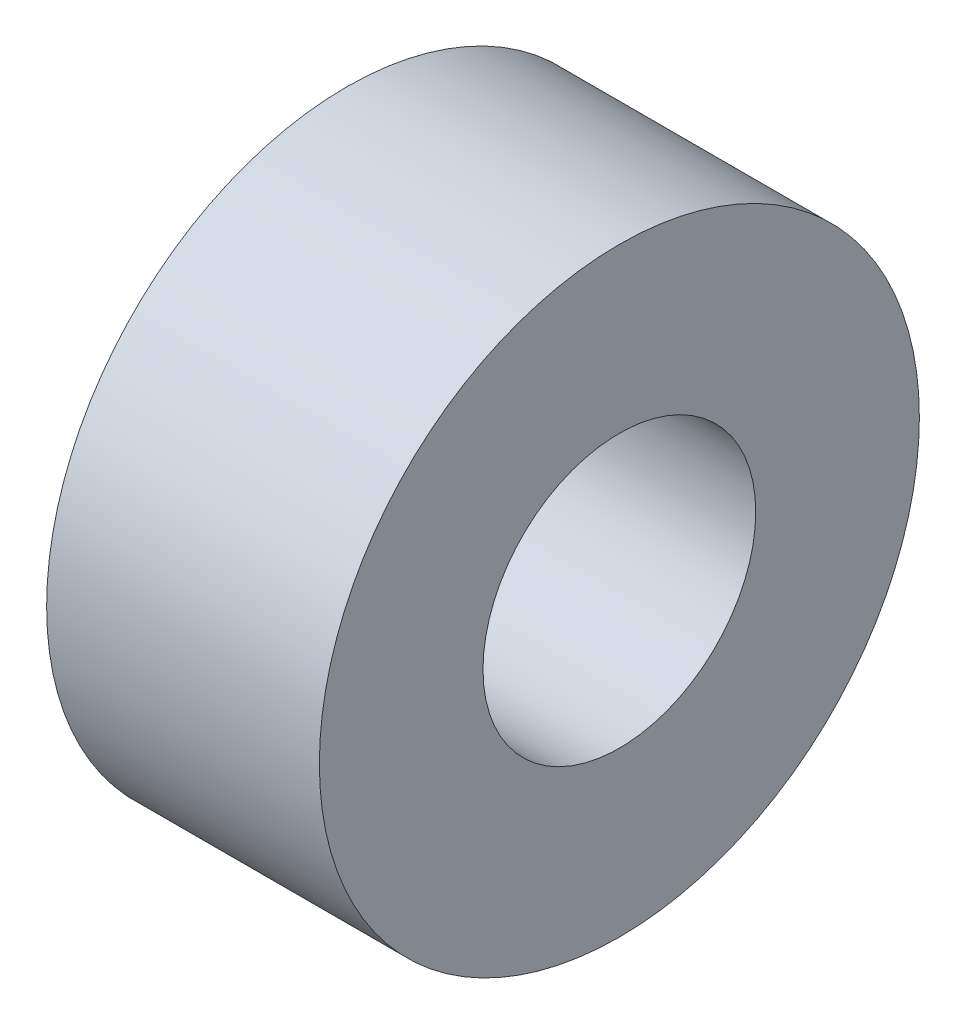
ISO-10303-21;
HEADER;
FILE_DESCRIPTION(('STEP AP214'),'2;1');
FILE_NAME('part.step','',(''),(''),'','','');
FILE_SCHEMA(('AUTOMOTIVE_DESIGN { 1 0 10303 214 1 1 1 1 }'));
ENDSEC;
DATA;
#1=APPLICATION_CONTEXT('core data for automotive mechanical design processes');
#2=APPLICATION_PROTOCOL_DEFINITION('international standard','automotive_design',2000,#1);
#3=PRODUCT_CONTEXT('',#1,'mechanical');
#4=PRODUCT('Part','Part','',(#3));
#5=PRODUCT_RELATED_PRODUCT_CATEGORY('part','',(#4));
#6=PRODUCT_DEFINITION_FORMATION('','',#4);
#7=PRODUCT_DEFINITION_CONTEXT('part definition',#1,'design');
#8=PRODUCT_DEFINITION('design','',#6,#7);
#9=PRODUCT_DEFINITION_SHAPE('','',#8);
#10=(LENGTH_UNIT() NAMED_UNIT(*) SI_UNIT(.MILLI.,.METRE.));
#11=(NAMED_UNIT(*) PLANE_ANGLE_UNIT() SI_UNIT($,.RADIAN.));
#12=(NAMED_UNIT(*) SI_UNIT($,.STERADIAN.) SOLID_ANGLE_UNIT());
#13=UNCERTAINTY_MEASURE_WITH_UNIT(LENGTH_MEASURE(1.E-05),#10,'distance_accuracy_value','');
#14=(GEOMETRIC_REPRESENTATION_CONTEXT(3) GLOBAL_UNCERTAINTY_ASSIGNED_CONTEXT((#13)) GLOBAL_UNIT_ASSIGNED_CONTEXT((#10,
#11,#12)) REPRESENTATION_CONTEXT('',''));
#15=CARTESIAN_POINT('',(0.,0.,0.));
#16=DIRECTION('',(0.,0.,1.));
#17=DIRECTION('',(1.,0.,0.));
#18=AXIS2_PLACEMENT_3D('',#15,#16,#17);
#19=CARTESIAN_POINT('',(3.96875,0.,0.));
#20=DIRECTION('',(1.,0.,0.));
#21=DIRECTION('',(0.,0.,-1.));
#22=AXIS2_PLACEMENT_3D('',#19,#20,#21);
#23=PLANE('',#22);
#24=CARTESIAN_POINT('',(3.96875,0.,0.));
#25=DIRECTION('',(1.,0.,0.));
#26=DIRECTION('',(0.,0.,-1.));
#27=AXIS2_PLACEMENT_3D('',#24,#25,#26);
#28=CIRCLE('',#27,8.73125);
#29=CARTESIAN_POINT('',(3.96875,0.,-8.73125));
#30=VERTEX_POINT('',#29);
#31=EDGE_CURVE('E10',#30,#30,#28,.T.);
#32=ORIENTED_EDGE('',*,*,#31,.T.);
#33=EDGE_LOOP('',(#32));
#34=FACE_BOUND('',#33,.T.);
#35=CARTESIAN_POINT('',(3.96875,0.,0.));
#36=DIRECTION('',(1.,0.,0.));
#37=DIRECTION('',(0.,0.,-1.));
#38=AXIS2_PLACEMENT_3D('',#35,#36,#37);
#39=CIRCLE('',#38,3.96875);
#40=CARTESIAN_POINT('',(3.96875,0.,-3.96875));
#41=VERTEX_POINT('',#40);
#42=EDGE_CURVE('E46',#41,#41,#39,.T.);
#43=ORIENTED_EDGE('',*,*,#42,.F.);
#44=EDGE_LOOP('',(#43));
#45=FACE_BOUND('',#44,.T.);
#46=ADVANCED_FACE('F35',(#34,#45),#23,.T.);
#47=CARTESIAN_POINT('',(-3.96875,0.,0.));
#48=DIRECTION('',(1.,0.,0.));
#49=DIRECTION('',(0.,0.,-1.));
#50=AXIS2_PLACEMENT_3D('',#47,#48,#49);
#51=PLANE('',#50);
#52=CARTESIAN_POINT('',(-3.96875,0.,0.));
#53=DIRECTION('',(1.,0.,0.));
#54=DIRECTION('',(0.,0.,-1.));
#55=AXIS2_PLACEMENT_3D('',#52,#53,#54);
#56=CIRCLE('',#55,8.73125);
#57=CARTESIAN_POINT('',(-3.96875,0.,-8.73125));
#58=VERTEX_POINT('',#57);
#59=EDGE_CURVE('E39',#58,#58,#56,.T.);
#60=ORIENTED_EDGE('',*,*,#59,.F.);
#61=EDGE_LOOP('',(#60));
#62=FACE_BOUND('',#61,.T.);
#63=CARTESIAN_POINT('',(-3.96875,0.,0.));
#64=DIRECTION('',(1.,0.,0.));
#65=DIRECTION('',(0.,0.,-1.));
#66=AXIS2_PLACEMENT_3D('',#63,#64,#65);
#67=CIRCLE('',#66,3.96875);
#68=CARTESIAN_POINT('',(-3.96875,0.,-3.96875));
#69=VERTEX_POINT('',#68);
#70=EDGE_CURVE('E48',#69,#69,#67,.T.);
#71=ORIENTED_EDGE('',*,*,#70,.T.);
#72=EDGE_LOOP('',(#71));
#73=FACE_BOUND('',#72,.T.);
#74=ADVANCED_FACE('F58',(#62,#73),#51,.F.);
#75=CARTESIAN_POINT('',(3.96875,0.,0.));
#76=DIRECTION('',(-1.,0.,0.));
#77=DIRECTION('',(0.,0.,1.));
#78=AXIS2_PLACEMENT_3D('',#75,#76,#77);
#79=CYLINDRICAL_SURFACE('',#78,8.73125);
#80=ORIENTED_EDGE('',*,*,#31,.F.);
#81=EDGE_LOOP('',(#80));
#82=FACE_BOUND('',#81,.T.);
#83=ORIENTED_EDGE('',*,*,#59,.T.);
#84=EDGE_LOOP('',(#83));
#85=FACE_BOUND('',#84,.T.);
#86=ADVANCED_FACE('F37',(#82,#85),#79,.T.);
#87=CARTESIAN_POINT('',(3.96875,0.,0.));
#88=DIRECTION('',(-1.,0.,0.));
#89=DIRECTION('',(0.,0.,1.));
#90=AXIS2_PLACEMENT_3D('',#87,#88,#89);
#91=CYLINDRICAL_SURFACE('',#90,3.96875);
#92=ORIENTED_EDGE('',*,*,#42,.T.);
#93=EDGE_LOOP('',(#92));
#94=FACE_BOUND('',#93,.T.);
#95=ORIENTED_EDGE('',*,*,#70,.F.);
#96=EDGE_LOOP('',(#95));
#97=FACE_BOUND('',#96,.T.);
#98=ADVANCED_FACE('F54',(#94,#97),#91,.F.);
#99=CLOSED_SHELL('',(#46,#74,#86,#98));
#100=MANIFOLD_SOLID_BREP('B2',#99);
#101=ADVANCED_BREP_SHAPE_REPRESENTATION('',(#18,#100),#14);
#102=SHAPE_DEFINITION_REPRESENTATION(#9,#101);
ENDSEC;
END-ISO-10303-21;
